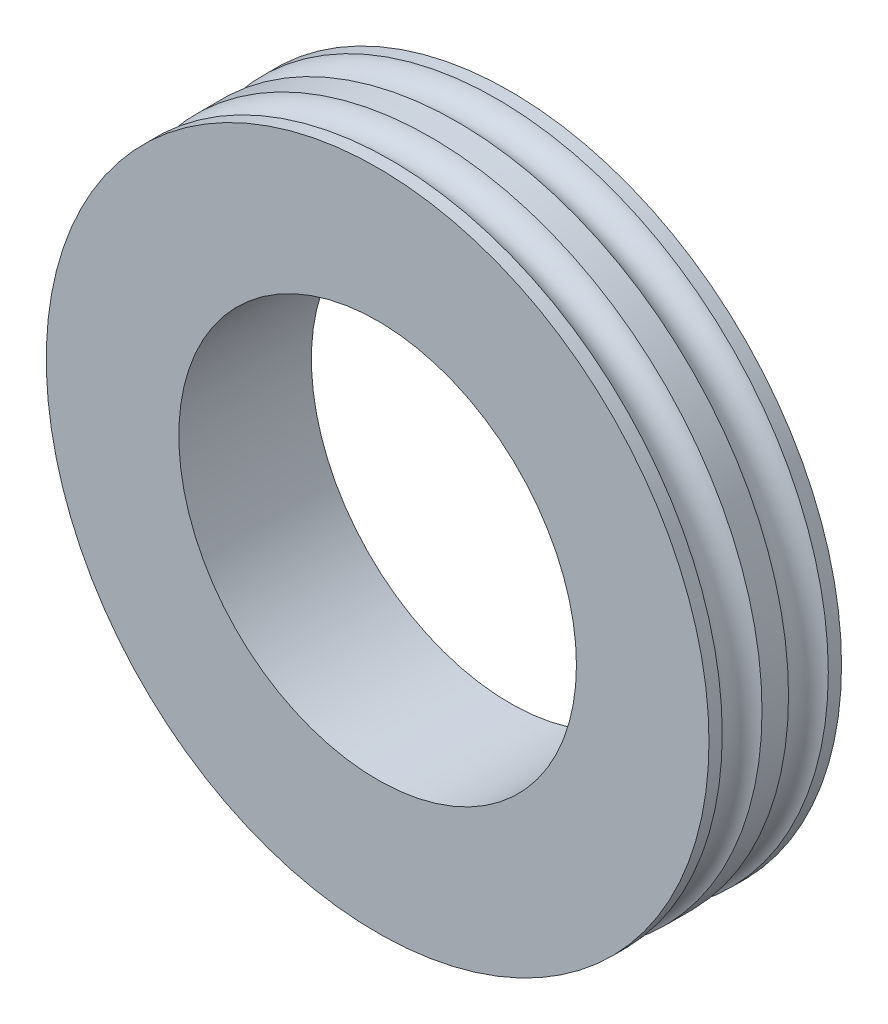
ISO-10303-21;
HEADER;
FILE_DESCRIPTION(('STEP AP214'),'2;1');
FILE_NAME('part.step','',(''),(''),'','','');
FILE_SCHEMA(('AUTOMOTIVE_DESIGN { 1 0 10303 214 1 1 1 1 }'));
ENDSEC;
DATA;
#1=APPLICATION_CONTEXT('core data for automotive mechanical design processes');
#2=APPLICATION_PROTOCOL_DEFINITION('international standard','automotive_design',2000,#1);
#3=PRODUCT_CONTEXT('',#1,'mechanical');
#4=PRODUCT('Part','Part','',(#3));
#5=PRODUCT_RELATED_PRODUCT_CATEGORY('part','',(#4));
#6=PRODUCT_DEFINITION_FORMATION('','',#4);
#7=PRODUCT_DEFINITION_CONTEXT('part definition',#1,'design');
#8=PRODUCT_DEFINITION('design','',#6,#7);
#9=PRODUCT_DEFINITION_SHAPE('','',#8);
#10=(LENGTH_UNIT() NAMED_UNIT(*) SI_UNIT(.MILLI.,.METRE.));
#11=(NAMED_UNIT(*) PLANE_ANGLE_UNIT() SI_UNIT($,.RADIAN.));
#12=(NAMED_UNIT(*) SI_UNIT($,.STERADIAN.) SOLID_ANGLE_UNIT());
#13=UNCERTAINTY_MEASURE_WITH_UNIT(LENGTH_MEASURE(1.E-05),#10,'distance_accuracy_value','');
#14=(GEOMETRIC_REPRESENTATION_CONTEXT(3) GLOBAL_UNCERTAINTY_ASSIGNED_CONTEXT((#13)) GLOBAL_UNIT_ASSIGNED_CONTEXT((#10,
#11,#12)) REPRESENTATION_CONTEXT('',''));
#15=CARTESIAN_POINT('',(0.,0.,0.));
#16=DIRECTION('',(0.,0.,1.));
#17=DIRECTION('',(1.,0.,0.));
#18=AXIS2_PLACEMENT_3D('',#15,#16,#17);
#19=CARTESIAN_POINT('',(0.,0.,3.0146773668033));
#20=DIRECTION('',(0.,0.,1.));
#21=DIRECTION('',(1.,0.,0.));
#22=AXIS2_PLACEMENT_3D('',#19,#20,#21);
#23=CYLINDRICAL_SURFACE('',#22,5.);
#24=CARTESIAN_POINT('',(0.,0.,0.2));
#25=DIRECTION('',(0.,0.,1.));
#26=DIRECTION('',(1.,0.,0.));
#27=AXIS2_PLACEMENT_3D('',#24,#25,#26);
#28=CIRCLE('',#27,5.);
#29=CARTESIAN_POINT('',(5.,0.,0.2));
#30=VERTEX_POINT('',#29);
#31=EDGE_CURVE('E10',#30,#30,#28,.T.);
#32=ORIENTED_EDGE('',*,*,#31,.F.);
#33=EDGE_LOOP('',(#32));
#34=FACE_BOUND('',#33,.T.);
#35=CARTESIAN_POINT('',(0.,0.,-0.2));
#36=DIRECTION('',(0.,0.,1.));
#37=DIRECTION('',(1.,0.,0.));
#38=AXIS2_PLACEMENT_3D('',#35,#36,#37);
#39=CIRCLE('',#38,5.);
#40=CARTESIAN_POINT('',(5.,0.,-0.2));
#41=VERTEX_POINT('',#40);
#42=EDGE_CURVE('E60',#41,#41,#39,.T.);
#43=ORIENTED_EDGE('',*,*,#42,.T.);
#44=EDGE_LOOP('',(#43));
#45=FACE_BOUND('',#44,.T.);
#46=ADVANCED_FACE('F37',(#34,#45),#23,.T.);
#47=CARTESIAN_POINT('',(0.,0.,0.5));
#48=DIRECTION('',(0.,0.,1.));
#49=DIRECTION('',(1.,0.,0.));
#50=AXIS2_PLACEMENT_3D('',#47,#48,#49);
#51=TOROIDAL_SURFACE('',#50,5.1,0.316227766016838);
#52=CARTESIAN_POINT('',(0.,0.,0.8));
#53=DIRECTION('',(0.,0.,1.));
#54=DIRECTION('',(1.,0.,0.));
#55=AXIS2_PLACEMENT_3D('',#52,#53,#54);
#56=CIRCLE('',#55,5.);
#57=CARTESIAN_POINT('',(5.,0.,0.8));
#58=VERTEX_POINT('',#57);
#59=EDGE_CURVE('E44',#58,#58,#56,.T.);
#60=ORIENTED_EDGE('',*,*,#59,.F.);
#61=EDGE_LOOP('',(#60));
#62=FACE_BOUND('',#61,.T.);
#63=ORIENTED_EDGE('',*,*,#31,.T.);
#64=EDGE_LOOP('',(#63));
#65=FACE_BOUND('',#64,.T.);
#66=ADVANCED_FACE('F97',(#62,#65),#51,.F.);
#67=CARTESIAN_POINT('',(0.,0.,3.0146773668033));
#68=DIRECTION('',(0.,0.,1.));
#69=DIRECTION('',(1.,0.,0.));
#70=AXIS2_PLACEMENT_3D('',#67,#68,#69);
#71=CYLINDRICAL_SURFACE('',#70,5.);
#72=CARTESIAN_POINT('',(0.,0.,1.));
#73=DIRECTION('',(0.,0.,1.));
#74=DIRECTION('',(1.,0.,0.));
#75=AXIS2_PLACEMENT_3D('',#72,#73,#74);
#76=CIRCLE('',#75,5.);
#77=CARTESIAN_POINT('',(5.,0.,1.));
#78=VERTEX_POINT('',#77);
#79=EDGE_CURVE('E49',#78,#78,#76,.T.);
#80=ORIENTED_EDGE('',*,*,#79,.F.);
#81=EDGE_LOOP('',(#80));
#82=FACE_BOUND('',#81,.T.);
#83=ORIENTED_EDGE('',*,*,#59,.T.);
#84=EDGE_LOOP('',(#83));
#85=FACE_BOUND('',#84,.T.);
#86=ADVANCED_FACE('F93',(#82,#85),#71,.T.);
#87=CARTESIAN_POINT('',(0.,5.,1.));
#88=DIRECTION('',(0.,0.,-1.));
#89=DIRECTION('',(-1.,0.,0.));
#90=AXIS2_PLACEMENT_3D('',#87,#88,#89);
#91=PLANE('',#90);
#92=CARTESIAN_POINT('',(0.,0.,1.));
#93=DIRECTION('',(0.,0.,1.));
#94=DIRECTION('',(1.,0.,0.));
#95=AXIS2_PLACEMENT_3D('',#92,#93,#94);
#96=CIRCLE('',#95,3.);
#97=CARTESIAN_POINT('',(3.,0.,1.));
#98=VERTEX_POINT('',#97);
#99=EDGE_CURVE('E54',#98,#98,#96,.T.);
#100=ORIENTED_EDGE('',*,*,#99,.F.);
#101=EDGE_LOOP('',(#100));
#102=FACE_BOUND('',#101,.T.);
#103=ORIENTED_EDGE('',*,*,#79,.T.);
#104=EDGE_LOOP('',(#103));
#105=FACE_BOUND('',#104,.T.);
#106=ADVANCED_FACE('F83',(#102,#105),#91,.F.);
#107=CARTESIAN_POINT('',(0.,0.,3.0146773668033));
#108=DIRECTION('',(0.,0.,1.));
#109=DIRECTION('',(1.,0.,0.));
#110=AXIS2_PLACEMENT_3D('',#107,#108,#109);
#111=CYLINDRICAL_SURFACE('',#110,3.);
#112=ORIENTED_EDGE('',*,*,#99,.T.);
#113=EDGE_LOOP('',(#112));
#114=FACE_BOUND('',#113,.T.);
#115=CARTESIAN_POINT('',(0.,0.,-1.));
#116=DIRECTION('',(0.,0.,1.));
#117=DIRECTION('',(1.,0.,0.));
#118=AXIS2_PLACEMENT_3D('',#115,#116,#117);
#119=CIRCLE('',#118,3.);
#120=CARTESIAN_POINT('',(3.,0.,-1.));
#121=VERTEX_POINT('',#120);
#122=EDGE_CURVE('E72',#121,#121,#119,.T.);
#123=ORIENTED_EDGE('',*,*,#122,.F.);
#124=EDGE_LOOP('',(#123));
#125=FACE_BOUND('',#124,.T.);
#126=ADVANCED_FACE('F80',(#114,#125),#111,.F.);
#127=CARTESIAN_POINT('',(0.,0.,-0.5));
#128=DIRECTION('',(0.,0.,-1.));
#129=DIRECTION('',(1.,0.,0.));
#130=AXIS2_PLACEMENT_3D('',#127,#128,#129);
#131=TOROIDAL_SURFACE('',#130,5.1,0.316227766016838);
#132=CARTESIAN_POINT('',(0.,0.,-0.8));
#133=DIRECTION('',(0.,0.,1.));
#134=DIRECTION('',(1.,0.,0.));
#135=AXIS2_PLACEMENT_3D('',#132,#133,#134);
#136=CIRCLE('',#135,5.);
#137=CARTESIAN_POINT('',(5.,0.,-0.8));
#138=VERTEX_POINT('',#137);
#139=EDGE_CURVE('E64',#138,#138,#136,.T.);
#140=ORIENTED_EDGE('',*,*,#139,.T.);
#141=EDGE_LOOP('',(#140));
#142=FACE_BOUND('',#141,.T.);
#143=ORIENTED_EDGE('',*,*,#42,.F.);
#144=EDGE_LOOP('',(#143));
#145=FACE_BOUND('',#144,.T.);
#146=ADVANCED_FACE('F82',(#142,#145),#131,.F.);
#147=CARTESIAN_POINT('',(0.,0.,-3.0146773668033));
#148=DIRECTION('',(0.,0.,-1.));
#149=DIRECTION('',(1.,0.,0.));
#150=AXIS2_PLACEMENT_3D('',#147,#148,#149);
#151=CYLINDRICAL_SURFACE('',#150,5.);
#152=CARTESIAN_POINT('',(0.,0.,-1.));
#153=DIRECTION('',(0.,0.,1.));
#154=DIRECTION('',(1.,0.,0.));
#155=AXIS2_PLACEMENT_3D('',#152,#153,#154);
#156=CIRCLE('',#155,5.);
#157=CARTESIAN_POINT('',(5.,0.,-1.));
#158=VERTEX_POINT('',#157);
#159=EDGE_CURVE('E68',#158,#158,#156,.T.);
#160=ORIENTED_EDGE('',*,*,#159,.T.);
#161=EDGE_LOOP('',(#160));
#162=FACE_BOUND('',#161,.T.);
#163=ORIENTED_EDGE('',*,*,#139,.F.);
#164=EDGE_LOOP('',(#163));
#165=FACE_BOUND('',#164,.T.);
#166=ADVANCED_FACE('F90',(#162,#165),#151,.T.);
#167=CARTESIAN_POINT('',(0.,5.,-1.));
#168=DIRECTION('',(0.,0.,1.));
#169=DIRECTION('',(-1.,0.,0.));
#170=AXIS2_PLACEMENT_3D('',#167,#168,#169);
#171=PLANE('',#170);
#172=ORIENTED_EDGE('',*,*,#122,.T.);
#173=EDGE_LOOP('',(#172));
#174=FACE_BOUND('',#173,.T.);
#175=ORIENTED_EDGE('',*,*,#159,.F.);
#176=EDGE_LOOP('',(#175));
#177=FACE_BOUND('',#176,.T.);
#178=ADVANCED_FACE('F77',(#174,#177),#171,.F.);
#179=CLOSED_SHELL('',(#46,#66,#86,#106,#126,#146,#166,#178));
#180=MANIFOLD_SOLID_BREP('B2',#179);
#181=ADVANCED_BREP_SHAPE_REPRESENTATION('',(#18,#180),#14);
#182=SHAPE_DEFINITION_REPRESENTATION(#9,#181);
ENDSEC;
END-ISO-10303-21;
